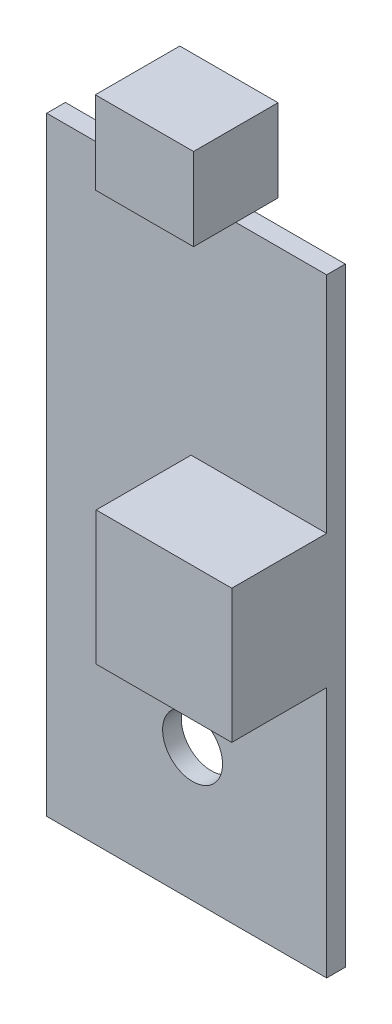
ISO-10303-21;
HEADER;
FILE_DESCRIPTION(('STEP AP214'),'2;1');
FILE_NAME('part.step','',(''),(''),'','','');
FILE_SCHEMA(('AUTOMOTIVE_DESIGN { 1 0 10303 214 1 1 1 1 }'));
ENDSEC;
DATA;
#1=APPLICATION_CONTEXT('core data for automotive mechanical design processes');
#2=APPLICATION_PROTOCOL_DEFINITION('international standard','automotive_design',2000,#1);
#3=PRODUCT_CONTEXT('',#1,'mechanical');
#4=PRODUCT('Part','Part','',(#3));
#5=PRODUCT_RELATED_PRODUCT_CATEGORY('part','',(#4));
#6=PRODUCT_DEFINITION_FORMATION('','',#4);
#7=PRODUCT_DEFINITION_CONTEXT('part definition',#1,'design');
#8=PRODUCT_DEFINITION('design','',#6,#7);
#9=PRODUCT_DEFINITION_SHAPE('','',#8);
#10=(LENGTH_UNIT() NAMED_UNIT(*) SI_UNIT(.MILLI.,.METRE.));
#11=(NAMED_UNIT(*) PLANE_ANGLE_UNIT() SI_UNIT($,.RADIAN.));
#12=(NAMED_UNIT(*) SI_UNIT($,.STERADIAN.) SOLID_ANGLE_UNIT());
#13=UNCERTAINTY_MEASURE_WITH_UNIT(LENGTH_MEASURE(1.E-05),#10,'distance_accuracy_value','');
#14=(GEOMETRIC_REPRESENTATION_CONTEXT(3) GLOBAL_UNCERTAINTY_ASSIGNED_CONTEXT((#13)) GLOBAL_UNIT_ASSIGNED_CONTEXT((#10,
#11,#12)) REPRESENTATION_CONTEXT('',''));
#15=CARTESIAN_POINT('',(0.,0.,0.));
#16=DIRECTION('',(0.,0.,1.));
#17=DIRECTION('',(1.,0.,0.));
#18=AXIS2_PLACEMENT_3D('',#15,#16,#17);
#19=CARTESIAN_POINT('',(0.,0.,0.));
#20=DIRECTION('',(0.,0.,1.));
#21=DIRECTION('',(1.,0.,0.));
#22=AXIS2_PLACEMENT_3D('',#19,#20,#21);
#23=PLANE('',#22);
#24=CARTESIAN_POINT('',(0.3,-8.72499999999999,0.));
#25=DIRECTION('',(0.,0.,1.));
#26=DIRECTION('',(1.,0.,0.));
#27=AXIS2_PLACEMENT_3D('',#24,#25,#26);
#28=CIRCLE('',#27,1.525);
#29=CARTESIAN_POINT('',(1.825,-8.72499999999999,0.));
#30=VERTEX_POINT('',#29);
#31=EDGE_CURVE('E301',#30,#30,#28,.T.);
#32=ORIENTED_EDGE('',*,*,#31,.F.);
#33=EDGE_LOOP('',(#32));
#34=FACE_BOUND('',#33,.T.);
#35=DIRECTION('',(0.,-1.,0.));
#36=VECTOR('',#35,1.);
#37=CARTESIAN_POINT('',(7.125,0.,0.));
#38=LINE('',#37,#36);
#39=CARTESIAN_POINT('',(7.125,-2.7,0.));
#40=VERTEX_POINT('',#39);
#41=CARTESIAN_POINT('',(7.125,-15.5,0.));
#42=VERTEX_POINT('',#41);
#43=EDGE_CURVE('E215',#40,#42,#38,.T.);
#44=ORIENTED_EDGE('',*,*,#43,.F.);
#45=DIRECTION('',(1.,0.,0.));
#46=VECTOR('',#45,1.);
#47=CARTESIAN_POINT('',(0.,-2.7,0.));
#48=LINE('',#47,#46);
#49=CARTESIAN_POINT('',(0.224999999999995,-2.7,0.));
#50=VERTEX_POINT('',#49);
#51=EDGE_CURVE('E285',#50,#40,#48,.T.);
#52=ORIENTED_EDGE('',*,*,#51,.F.);
#53=DIRECTION('',(0.,-1.,0.));
#54=VECTOR('',#53,1.);
#55=CARTESIAN_POINT('',(0.224999999999995,0.,0.));
#56=LINE('',#55,#54);
#57=CARTESIAN_POINT('',(0.224999999999995,4.1,0.));
#58=VERTEX_POINT('',#57);
#59=EDGE_CURVE('E177',#58,#50,#56,.T.);
#60=ORIENTED_EDGE('',*,*,#59,.F.);
#61=DIRECTION('',(-1.,0.,0.));
#62=VECTOR('',#61,1.);
#63=CARTESIAN_POINT('',(0.,4.1,0.));
#64=LINE('',#63,#62);
#65=CARTESIAN_POINT('',(7.125,4.1,0.));
#66=VERTEX_POINT('',#65);
#67=EDGE_CURVE('E173',#66,#58,#64,.T.);
#68=ORIENTED_EDGE('',*,*,#67,.F.);
#69=CARTESIAN_POINT('',(7.125,15.5,0.));
#70=VERTEX_POINT('',#69);
#71=EDGE_CURVE('E245',#70,#66,#38,.T.);
#72=ORIENTED_EDGE('',*,*,#71,.F.);
#73=DIRECTION('',(1.,0.,0.));
#74=VECTOR('',#73,1.);
#75=CARTESIAN_POINT('',(0.,15.5,0.));
#76=LINE('',#75,#74);
#77=CARTESIAN_POINT('',(2.5,15.5,0.));
#78=VERTEX_POINT('',#77);
#79=EDGE_CURVE('E249',#78,#70,#76,.T.);
#80=ORIENTED_EDGE('',*,*,#79,.F.);
#81=CARTESIAN_POINT('',(-2.5,15.5,0.));
#82=VERTEX_POINT('',#81);
#83=EDGE_CURVE('E255',#82,#78,#76,.T.);
#84=ORIENTED_EDGE('',*,*,#83,.F.);
#85=CARTESIAN_POINT('',(-7.125,15.5,0.));
#86=VERTEX_POINT('',#85);
#87=EDGE_CURVE('E250',#86,#82,#76,.T.);
#88=ORIENTED_EDGE('',*,*,#87,.F.);
#89=DIRECTION('',(0.,-1.,0.));
#90=VECTOR('',#89,1.);
#91=CARTESIAN_POINT('',(-7.125,0.,0.));
#92=LINE('',#91,#90);
#93=CARTESIAN_POINT('',(-7.125,-15.5,0.));
#94=VERTEX_POINT('',#93);
#95=EDGE_CURVE('E254',#86,#94,#92,.T.);
#96=ORIENTED_EDGE('',*,*,#95,.T.);
#97=DIRECTION('',(1.,0.,0.));
#98=VECTOR('',#97,1.);
#99=CARTESIAN_POINT('',(0.,-15.5,0.));
#100=LINE('',#99,#98);
#101=EDGE_CURVE('E230',#94,#42,#100,.T.);
#102=ORIENTED_EDGE('',*,*,#101,.T.);
#103=EDGE_LOOP('',(#44,#52,#60,#68,#72,#80,#84,#88,#96,#102));
#104=FACE_BOUND('',#103,.T.);
#105=ADVANCED_FACE('F46',(#34,#104),#23,.T.);
#106=CARTESIAN_POINT('',(0.,15.5,-0.95));
#107=DIRECTION('',(0.,-1.,0.));
#108=DIRECTION('',(1.,0.,0.));
#109=AXIS2_PLACEMENT_3D('',#106,#107,#108);
#110=PLANE('',#109);
#111=DIRECTION('',(0.,0.,1.));
#112=VECTOR('',#111,1.);
#113=CARTESIAN_POINT('',(-2.5,15.5,-2.15));
#114=LINE('',#113,#112);
#115=CARTESIAN_POINT('',(-2.5,15.5,-0.950000000000001));
#116=VERTEX_POINT('',#115);
#117=EDGE_CURVE('E11',#116,#82,#114,.T.);
#118=ORIENTED_EDGE('',*,*,#117,.F.);
#119=DIRECTION('',(1.,0.,0.));
#120=VECTOR('',#119,1.);
#121=CARTESIAN_POINT('',(0.,15.5,-0.95));
#122=LINE('',#121,#120);
#123=CARTESIAN_POINT('',(-7.125,15.5,-0.95));
#124=VERTEX_POINT('',#123);
#125=EDGE_CURVE('E231',#124,#116,#122,.T.);
#126=ORIENTED_EDGE('',*,*,#125,.F.);
#127=DIRECTION('',(0.,0.,1.));
#128=VECTOR('',#127,1.);
#129=CARTESIAN_POINT('',(-7.125,15.5,-0.95));
#130=LINE('',#129,#128);
#131=EDGE_CURVE('E269',#124,#86,#130,.T.);
#132=ORIENTED_EDGE('',*,*,#131,.T.);
#133=ORIENTED_EDGE('',*,*,#87,.T.);
#134=EDGE_LOOP('',(#118,#126,#132,#133));
#135=FACE_BOUND('',#134,.T.);
#136=ADVANCED_FACE('F313',(#135),#110,.F.);
#137=CARTESIAN_POINT('',(7.125,0.,-0.95));
#138=DIRECTION('',(-1.,0.,0.));
#139=DIRECTION('',(0.,-1.,0.));
#140=AXIS2_PLACEMENT_3D('',#137,#138,#139);
#141=PLANE('',#140);
#142=ORIENTED_EDGE('',*,*,#71,.T.);
#143=DIRECTION('',(0.,0.,-1.));
#144=VECTOR('',#143,1.);
#145=CARTESIAN_POINT('',(7.125,4.1,4.83));
#146=LINE('',#145,#144);
#147=CARTESIAN_POINT('',(7.125,4.1,4.83));
#148=VERTEX_POINT('',#147);
#149=EDGE_CURVE('E66',#148,#66,#146,.T.);
#150=ORIENTED_EDGE('',*,*,#149,.F.);
#151=DIRECTION('',(0.,1.,0.));
#152=VECTOR('',#151,1.);
#153=CARTESIAN_POINT('',(7.125,0.,4.83));
#154=LINE('',#153,#152);
#155=CARTESIAN_POINT('',(7.125,-2.7,4.83));
#156=VERTEX_POINT('',#155);
#157=EDGE_CURVE('E163',#156,#148,#154,.T.);
#158=ORIENTED_EDGE('',*,*,#157,.F.);
#159=DIRECTION('',(0.,0.,-1.));
#160=VECTOR('',#159,1.);
#161=CARTESIAN_POINT('',(7.125,-2.7,4.83));
#162=LINE('',#161,#160);
#163=EDGE_CURVE('E159',#156,#40,#162,.T.);
#164=ORIENTED_EDGE('',*,*,#163,.T.);
#165=ORIENTED_EDGE('',*,*,#43,.T.);
#166=DIRECTION('',(0.,0.,1.));
#167=VECTOR('',#166,1.);
#168=CARTESIAN_POINT('',(7.125,-15.5,-0.95));
#169=LINE('',#168,#167);
#170=CARTESIAN_POINT('',(7.125,-15.5,-0.95));
#171=VERTEX_POINT('',#170);
#172=EDGE_CURVE('E262',#171,#42,#169,.T.);
#173=ORIENTED_EDGE('',*,*,#172,.F.);
#174=DIRECTION('',(0.,-1.,0.));
#175=VECTOR('',#174,1.);
#176=CARTESIAN_POINT('',(7.125,0.,-0.95));
#177=LINE('',#176,#175);
#178=CARTESIAN_POINT('',(7.125,15.5,-0.95));
#179=VERTEX_POINT('',#178);
#180=EDGE_CURVE('E226',#179,#171,#177,.T.);
#181=ORIENTED_EDGE('',*,*,#180,.F.);
#182=DIRECTION('',(0.,0.,1.));
#183=VECTOR('',#182,1.);
#184=CARTESIAN_POINT('',(7.125,15.5,-0.95));
#185=LINE('',#184,#183);
#186=EDGE_CURVE('E244',#179,#70,#185,.T.);
#187=ORIENTED_EDGE('',*,*,#186,.T.);
#188=EDGE_LOOP('',(#142,#150,#158,#164,#165,#173,#181,#187));
#189=FACE_BOUND('',#188,.T.);
#190=ADVANCED_FACE('F48',(#189),#141,.F.);
#191=CARTESIAN_POINT('',(0.,-15.5,-0.95));
#192=DIRECTION('',(0.,-1.,0.));
#193=DIRECTION('',(0.,0.,-1.));
#194=AXIS2_PLACEMENT_3D('',#191,#192,#193);
#195=PLANE('',#194);
#196=ORIENTED_EDGE('',*,*,#101,.F.);
#197=DIRECTION('',(0.,0.,1.));
#198=VECTOR('',#197,1.);
#199=CARTESIAN_POINT('',(-7.125,-15.5,-0.95));
#200=LINE('',#199,#198);
#201=CARTESIAN_POINT('',(-7.125,-15.5,-0.95));
#202=VERTEX_POINT('',#201);
#203=EDGE_CURVE('E266',#202,#94,#200,.T.);
#204=ORIENTED_EDGE('',*,*,#203,.F.);
#205=DIRECTION('',(1.,0.,0.));
#206=VECTOR('',#205,1.);
#207=CARTESIAN_POINT('',(0.,-15.5,-0.95));
#208=LINE('',#207,#206);
#209=EDGE_CURVE('E240',#202,#171,#208,.T.);
#210=ORIENTED_EDGE('',*,*,#209,.T.);
#211=ORIENTED_EDGE('',*,*,#172,.T.);
#212=EDGE_LOOP('',(#196,#204,#210,#211));
#213=FACE_BOUND('',#212,.T.);
#214=ADVANCED_FACE('F324',(#213),#195,.T.);
#215=CARTESIAN_POINT('',(-7.125,0.,-0.95));
#216=DIRECTION('',(-1.,0.,0.));
#217=DIRECTION('',(0.,-1.,0.));
#218=AXIS2_PLACEMENT_3D('',#215,#216,#217);
#219=PLANE('',#218);
#220=ORIENTED_EDGE('',*,*,#95,.F.);
#221=ORIENTED_EDGE('',*,*,#131,.F.);
#222=DIRECTION('',(0.,-1.,0.));
#223=VECTOR('',#222,1.);
#224=CARTESIAN_POINT('',(-7.125,0.,-0.95));
#225=LINE('',#224,#223);
#226=EDGE_CURVE('E235',#124,#202,#225,.T.);
#227=ORIENTED_EDGE('',*,*,#226,.T.);
#228=ORIENTED_EDGE('',*,*,#203,.T.);
#229=EDGE_LOOP('',(#220,#221,#227,#228));
#230=FACE_BOUND('',#229,.T.);
#231=ADVANCED_FACE('F327',(#230),#219,.T.);
#232=CARTESIAN_POINT('',(2.5,15.5,-0.950000000000001));
#233=VERTEX_POINT('',#232);
#234=EDGE_CURVE('E229',#233,#179,#122,.T.);
#235=ORIENTED_EDGE('',*,*,#234,.F.);
#236=DIRECTION('',(0.,0.,1.));
#237=VECTOR('',#236,1.);
#238=CARTESIAN_POINT('',(2.5,15.5,-2.15));
#239=LINE('',#238,#237);
#240=EDGE_CURVE('E56',#233,#78,#239,.T.);
#241=ORIENTED_EDGE('',*,*,#240,.T.);
#242=ORIENTED_EDGE('',*,*,#79,.T.);
#243=ORIENTED_EDGE('',*,*,#186,.F.);
#244=EDGE_LOOP('',(#235,#241,#242,#243));
#245=FACE_BOUND('',#244,.T.);
#246=ADVANCED_FACE('F319',(#245),#110,.F.);
#247=CARTESIAN_POINT('',(0.,0.,-0.95));
#248=DIRECTION('',(0.,0.,1.));
#249=DIRECTION('',(1.,0.,0.));
#250=AXIS2_PLACEMENT_3D('',#247,#248,#249);
#251=PLANE('',#250);
#252=CARTESIAN_POINT('',(0.3,-8.72499999999999,-0.95));
#253=DIRECTION('',(0.,0.,1.));
#254=DIRECTION('',(1.,0.,0.));
#255=AXIS2_PLACEMENT_3D('',#252,#253,#254);
#256=CIRCLE('',#255,1.525);
#257=CARTESIAN_POINT('',(1.825,-8.72499999999999,-0.95));
#258=VERTEX_POINT('',#257);
#259=EDGE_CURVE('E50',#258,#258,#256,.T.);
#260=ORIENTED_EDGE('',*,*,#259,.T.);
#261=EDGE_LOOP('',(#260));
#262=FACE_BOUND('',#261,.T.);
#263=ORIENTED_EDGE('',*,*,#180,.T.);
#264=ORIENTED_EDGE('',*,*,#209,.F.);
#265=ORIENTED_EDGE('',*,*,#226,.F.);
#266=ORIENTED_EDGE('',*,*,#125,.T.);
#267=EDGE_CURVE('E236',#116,#233,#122,.T.);
#268=ORIENTED_EDGE('',*,*,#267,.T.);
#269=ORIENTED_EDGE('',*,*,#234,.T.);
#270=EDGE_LOOP('',(#263,#264,#265,#266,#268,#269));
#271=FACE_BOUND('',#270,.T.);
#272=ADVANCED_FACE('F322',(#262,#271),#251,.F.);
#273=CARTESIAN_POINT('',(0.,15.5,-2.15));
#274=DIRECTION('',(0.,-1.,0.));
#275=DIRECTION('',(1.,0.,0.));
#276=AXIS2_PLACEMENT_3D('',#273,#274,#275);
#277=PLANE('',#276);
#278=ORIENTED_EDGE('',*,*,#267,.F.);
#279=CARTESIAN_POINT('',(-2.5,15.5,-2.15));
#280=VERTEX_POINT('',#279);
#281=EDGE_CURVE('E58',#280,#116,#114,.T.);
#282=ORIENTED_EDGE('',*,*,#281,.F.);
#283=DIRECTION('',(1.,0.,0.));
#284=VECTOR('',#283,1.);
#285=CARTESIAN_POINT('',(0.,15.5,-2.15));
#286=LINE('',#285,#284);
#287=CARTESIAN_POINT('',(2.5,15.5,-2.15));
#288=VERTEX_POINT('',#287);
#289=EDGE_CURVE('E199',#280,#288,#286,.T.);
#290=ORIENTED_EDGE('',*,*,#289,.T.);
#291=EDGE_CURVE('E212',#288,#233,#239,.T.);
#292=ORIENTED_EDGE('',*,*,#291,.T.);
#293=EDGE_LOOP('',(#278,#282,#290,#292));
#294=FACE_BOUND('',#293,.T.);
#295=ADVANCED_FACE('F335',(#294),#277,.T.);
#296=CARTESIAN_POINT('',(2.5,0.,-2.15));
#297=DIRECTION('',(-1.,0.,0.));
#298=DIRECTION('',(0.,0.,1.));
#299=AXIS2_PLACEMENT_3D('',#296,#297,#298);
#300=PLANE('',#299);
#301=DIRECTION('',(0.,-1.,0.));
#302=VECTOR('',#301,1.);
#303=CARTESIAN_POINT('',(2.5,0.,2.15));
#304=LINE('',#303,#302);
#305=CARTESIAN_POINT('',(2.5,19.7,2.15));
#306=VERTEX_POINT('',#305);
#307=CARTESIAN_POINT('',(2.5,15.5,2.15));
#308=VERTEX_POINT('',#307);
#309=EDGE_CURVE('E180',#306,#308,#304,.T.);
#310=ORIENTED_EDGE('',*,*,#309,.T.);
#311=EDGE_CURVE('E74',#78,#308,#239,.T.);
#312=ORIENTED_EDGE('',*,*,#311,.F.);
#313=ORIENTED_EDGE('',*,*,#240,.F.);
#314=ORIENTED_EDGE('',*,*,#291,.F.);
#315=DIRECTION('',(0.,-1.,0.));
#316=VECTOR('',#315,1.);
#317=CARTESIAN_POINT('',(2.5,0.,-2.15));
#318=LINE('',#317,#316);
#319=CARTESIAN_POINT('',(2.5,19.7,-2.15));
#320=VERTEX_POINT('',#319);
#321=EDGE_CURVE('E189',#320,#288,#318,.T.);
#322=ORIENTED_EDGE('',*,*,#321,.F.);
#323=DIRECTION('',(0.,0.,1.));
#324=VECTOR('',#323,1.);
#325=CARTESIAN_POINT('',(2.5,19.7,-2.15));
#326=LINE('',#325,#324);
#327=EDGE_CURVE('E202',#320,#306,#326,.T.);
#328=ORIENTED_EDGE('',*,*,#327,.T.);
#329=EDGE_LOOP('',(#310,#312,#313,#314,#322,#328));
#330=FACE_BOUND('',#329,.T.);
#331=ADVANCED_FACE('F361',(#330),#300,.F.);
#332=CARTESIAN_POINT('',(-2.5,15.5,2.15));
#333=VERTEX_POINT('',#332);
#334=EDGE_CURVE('E59',#82,#333,#114,.T.);
#335=ORIENTED_EDGE('',*,*,#334,.F.);
#336=ORIENTED_EDGE('',*,*,#83,.T.);
#337=ORIENTED_EDGE('',*,*,#311,.T.);
#338=DIRECTION('',(1.,0.,0.));
#339=VECTOR('',#338,1.);
#340=CARTESIAN_POINT('',(0.,15.5,2.15));
#341=LINE('',#340,#339);
#342=EDGE_CURVE('E193',#333,#308,#341,.T.);
#343=ORIENTED_EDGE('',*,*,#342,.F.);
#344=EDGE_LOOP('',(#335,#336,#337,#343));
#345=FACE_BOUND('',#344,.T.);
#346=ADVANCED_FACE('F360',(#345),#277,.T.);
#347=CARTESIAN_POINT('',(-2.5,0.,-2.15));
#348=DIRECTION('',(1.,0.,0.));
#349=DIRECTION('',(0.,1.,0.));
#350=AXIS2_PLACEMENT_3D('',#347,#348,#349);
#351=PLANE('',#350);
#352=DIRECTION('',(0.,1.,0.));
#353=VECTOR('',#352,1.);
#354=CARTESIAN_POINT('',(-2.5,0.,2.15));
#355=LINE('',#354,#353);
#356=CARTESIAN_POINT('',(-2.5,19.7,2.15));
#357=VERTEX_POINT('',#356);
#358=EDGE_CURVE('E206',#333,#357,#355,.T.);
#359=ORIENTED_EDGE('',*,*,#358,.T.);
#360=DIRECTION('',(0.,0.,1.));
#361=VECTOR('',#360,1.);
#362=CARTESIAN_POINT('',(-2.5,19.7,-2.15));
#363=LINE('',#362,#361);
#364=CARTESIAN_POINT('',(-2.5,19.7,-2.15));
#365=VERTEX_POINT('',#364);
#366=EDGE_CURVE('E219',#365,#357,#363,.T.);
#367=ORIENTED_EDGE('',*,*,#366,.F.);
#368=DIRECTION('',(0.,1.,0.));
#369=VECTOR('',#368,1.);
#370=CARTESIAN_POINT('',(-2.5,0.,-2.15));
#371=LINE('',#370,#369);
#372=EDGE_CURVE('E196',#280,#365,#371,.T.);
#373=ORIENTED_EDGE('',*,*,#372,.F.);
#374=ORIENTED_EDGE('',*,*,#281,.T.);
#375=ORIENTED_EDGE('',*,*,#117,.T.);
#376=ORIENTED_EDGE('',*,*,#334,.T.);
#377=EDGE_LOOP('',(#359,#367,#373,#374,#375,#376));
#378=FACE_BOUND('',#377,.T.);
#379=ADVANCED_FACE('F351',(#378),#351,.F.);
#380=CARTESIAN_POINT('',(0.,19.7,-2.15));
#381=DIRECTION('',(0.,-1.,0.));
#382=DIRECTION('',(0.,0.,-1.));
#383=AXIS2_PLACEMENT_3D('',#380,#381,#382);
#384=PLANE('',#383);
#385=DIRECTION('',(1.,0.,0.));
#386=VECTOR('',#385,1.);
#387=CARTESIAN_POINT('',(0.,19.7,2.15));
#388=LINE('',#387,#386);
#389=EDGE_CURVE('E184',#357,#306,#388,.T.);
#390=ORIENTED_EDGE('',*,*,#389,.T.);
#391=ORIENTED_EDGE('',*,*,#327,.F.);
#392=DIRECTION('',(1.,0.,0.));
#393=VECTOR('',#392,1.);
#394=CARTESIAN_POINT('',(0.,19.7,-2.15));
#395=LINE('',#394,#393);
#396=EDGE_CURVE('E192',#365,#320,#395,.T.);
#397=ORIENTED_EDGE('',*,*,#396,.F.);
#398=ORIENTED_EDGE('',*,*,#366,.T.);
#399=EDGE_LOOP('',(#390,#391,#397,#398));
#400=FACE_BOUND('',#399,.T.);
#401=ADVANCED_FACE('F367',(#400),#384,.F.);
#402=CARTESIAN_POINT('',(0.,0.,-2.15));
#403=DIRECTION('',(0.,0.,1.));
#404=DIRECTION('',(1.,0.,0.));
#405=AXIS2_PLACEMENT_3D('',#402,#403,#404);
#406=PLANE('',#405);
#407=ORIENTED_EDGE('',*,*,#321,.T.);
#408=ORIENTED_EDGE('',*,*,#289,.F.);
#409=ORIENTED_EDGE('',*,*,#372,.T.);
#410=ORIENTED_EDGE('',*,*,#396,.T.);
#411=EDGE_LOOP('',(#407,#408,#409,#410));
#412=FACE_BOUND('',#411,.T.);
#413=ADVANCED_FACE('F371',(#412),#406,.F.);
#414=CARTESIAN_POINT('',(0.,0.,2.15));
#415=DIRECTION('',(0.,0.,1.));
#416=DIRECTION('',(1.,0.,0.));
#417=AXIS2_PLACEMENT_3D('',#414,#415,#416);
#418=PLANE('',#417);
#419=ORIENTED_EDGE('',*,*,#309,.F.);
#420=ORIENTED_EDGE('',*,*,#389,.F.);
#421=ORIENTED_EDGE('',*,*,#358,.F.);
#422=ORIENTED_EDGE('',*,*,#342,.T.);
#423=EDGE_LOOP('',(#419,#420,#421,#422));
#424=FACE_BOUND('',#423,.T.);
#425=ADVANCED_FACE('F359',(#424),#418,.T.);
#426=CARTESIAN_POINT('',(0.224999999999995,0.,4.83));
#427=DIRECTION('',(1.,0.,0.));
#428=DIRECTION('',(0.,0.,-1.));
#429=AXIS2_PLACEMENT_3D('',#426,#427,#428);
#430=PLANE('',#429);
#431=ORIENTED_EDGE('',*,*,#59,.T.);
#432=DIRECTION('',(0.,0.,-1.));
#433=VECTOR('',#432,1.);
#434=CARTESIAN_POINT('',(0.224999999999995,-2.7,4.83));
#435=LINE('',#434,#433);
#436=CARTESIAN_POINT('',(0.224999999999995,-2.7,4.83));
#437=VERTEX_POINT('',#436);
#438=EDGE_CURVE('E156',#437,#50,#435,.T.);
#439=ORIENTED_EDGE('',*,*,#438,.F.);
#440=DIRECTION('',(0.,-1.,0.));
#441=VECTOR('',#440,1.);
#442=CARTESIAN_POINT('',(0.224999999999995,0.,4.83));
#443=LINE('',#442,#441);
#444=CARTESIAN_POINT('',(0.224999999999995,4.1,4.83));
#445=VERTEX_POINT('',#444);
#446=EDGE_CURVE('E164',#445,#437,#443,.T.);
#447=ORIENTED_EDGE('',*,*,#446,.F.);
#448=DIRECTION('',(0.,0.,-1.));
#449=VECTOR('',#448,1.);
#450=CARTESIAN_POINT('',(0.224999999999995,4.1,4.83));
#451=LINE('',#450,#449);
#452=EDGE_CURVE('E291',#445,#58,#451,.T.);
#453=ORIENTED_EDGE('',*,*,#452,.T.);
#454=EDGE_LOOP('',(#431,#439,#447,#453));
#455=FACE_BOUND('',#454,.T.);
#456=ADVANCED_FACE('F175',(#455),#430,.F.);
#457=CARTESIAN_POINT('',(0.,-2.7,4.83));
#458=DIRECTION('',(0.,1.,0.));
#459=DIRECTION('',(0.,0.,1.));
#460=AXIS2_PLACEMENT_3D('',#457,#458,#459);
#461=PLANE('',#460);
#462=ORIENTED_EDGE('',*,*,#51,.T.);
#463=ORIENTED_EDGE('',*,*,#163,.F.);
#464=DIRECTION('',(1.,0.,0.));
#465=VECTOR('',#464,1.);
#466=CARTESIAN_POINT('',(0.,-2.7,4.83));
#467=LINE('',#466,#465);
#468=EDGE_CURVE('E152',#437,#156,#467,.T.);
#469=ORIENTED_EDGE('',*,*,#468,.F.);
#470=ORIENTED_EDGE('',*,*,#438,.T.);
#471=EDGE_LOOP('',(#462,#463,#469,#470));
#472=FACE_BOUND('',#471,.T.);
#473=ADVANCED_FACE('F154',(#472),#461,.F.);
#474=CARTESIAN_POINT('',(0.,4.1,4.83));
#475=DIRECTION('',(0.,-1.,0.));
#476=DIRECTION('',(1.,0.,0.));
#477=AXIS2_PLACEMENT_3D('',#474,#475,#476);
#478=PLANE('',#477);
#479=ORIENTED_EDGE('',*,*,#67,.T.);
#480=ORIENTED_EDGE('',*,*,#452,.F.);
#481=DIRECTION('',(-1.,0.,0.));
#482=VECTOR('',#481,1.);
#483=CARTESIAN_POINT('',(0.,4.1,4.83));
#484=LINE('',#483,#482);
#485=EDGE_CURVE('E168',#148,#445,#484,.T.);
#486=ORIENTED_EDGE('',*,*,#485,.F.);
#487=ORIENTED_EDGE('',*,*,#149,.T.);
#488=EDGE_LOOP('',(#479,#480,#486,#487));
#489=FACE_BOUND('',#488,.T.);
#490=ADVANCED_FACE('F400',(#489),#478,.F.);
#491=CARTESIAN_POINT('',(0.,0.,4.83));
#492=DIRECTION('',(0.,0.,1.));
#493=DIRECTION('',(1.,0.,0.));
#494=AXIS2_PLACEMENT_3D('',#491,#492,#493);
#495=PLANE('',#494);
#496=ORIENTED_EDGE('',*,*,#446,.T.);
#497=ORIENTED_EDGE('',*,*,#468,.T.);
#498=ORIENTED_EDGE('',*,*,#157,.T.);
#499=ORIENTED_EDGE('',*,*,#485,.T.);
#500=EDGE_LOOP('',(#496,#497,#498,#499));
#501=FACE_BOUND('',#500,.T.);
#502=ADVANCED_FACE('F167',(#501),#495,.T.);
#503=CARTESIAN_POINT('',(0.3,-8.72499999999999,-2.15));
#504=DIRECTION('',(0.,0.,1.));
#505=DIRECTION('',(1.,0.,0.));
#506=AXIS2_PLACEMENT_3D('',#503,#504,#505);
#507=CYLINDRICAL_SURFACE('',#506,1.525);
#508=ORIENTED_EDGE('',*,*,#31,.T.);
#509=EDGE_LOOP('',(#508));
#510=FACE_BOUND('',#509,.T.);
#511=ORIENTED_EDGE('',*,*,#259,.F.);
#512=EDGE_LOOP('',(#511));
#513=FACE_BOUND('',#512,.T.);
#514=ADVANCED_FACE('F309',(#510,#513),#507,.F.);
#515=CLOSED_SHELL('',(#105,#136,#190,#214,#231,#246,#272,#295,#331,#346,#379,#401,#413,#425,
#456,#473,#490,#502,#514));
#516=MANIFOLD_SOLID_BREP('B2',#515);
#517=ADVANCED_BREP_SHAPE_REPRESENTATION('',(#18,#516),#14);
#518=SHAPE_DEFINITION_REPRESENTATION(#9,#517);
ENDSEC;
END-ISO-10303-21;
